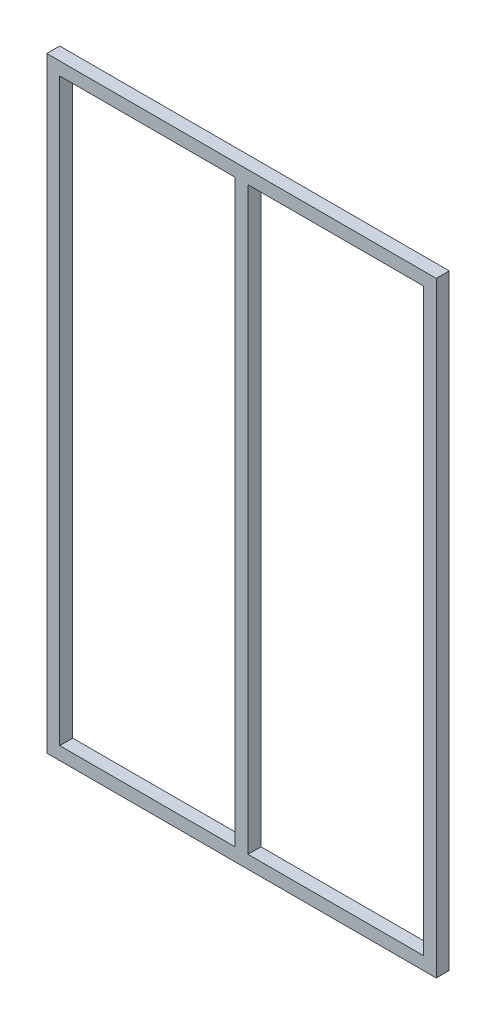
ISO-10303-21;
HEADER;
FILE_DESCRIPTION(('STEP AP214'),'2;1');
FILE_NAME('part.step','',(''),(''),'','','');
FILE_SCHEMA(('AUTOMOTIVE_DESIGN { 1 0 10303 214 1 1 1 1 }'));
ENDSEC;
DATA;
#1=APPLICATION_CONTEXT('core data for automotive mechanical design processes');
#2=APPLICATION_PROTOCOL_DEFINITION('international standard','automotive_design',2000,#1);
#3=PRODUCT_CONTEXT('',#1,'mechanical');
#4=PRODUCT('Part','Part','',(#3));
#5=PRODUCT_RELATED_PRODUCT_CATEGORY('part','',(#4));
#6=PRODUCT_DEFINITION_FORMATION('','',#4);
#7=PRODUCT_DEFINITION_CONTEXT('part definition',#1,'design');
#8=PRODUCT_DEFINITION('design','',#6,#7);
#9=PRODUCT_DEFINITION_SHAPE('','',#8);
#10=(LENGTH_UNIT() NAMED_UNIT(*) SI_UNIT(.MILLI.,.METRE.));
#11=(NAMED_UNIT(*) PLANE_ANGLE_UNIT() SI_UNIT($,.RADIAN.));
#12=(NAMED_UNIT(*) SI_UNIT($,.STERADIAN.) SOLID_ANGLE_UNIT());
#13=UNCERTAINTY_MEASURE_WITH_UNIT(LENGTH_MEASURE(1.E-05),#10,'distance_accuracy_value','');
#14=(GEOMETRIC_REPRESENTATION_CONTEXT(3) GLOBAL_UNCERTAINTY_ASSIGNED_CONTEXT((#13)) GLOBAL_UNIT_ASSIGNED_CONTEXT((#10,
#11,#12)) REPRESENTATION_CONTEXT('',''));
#15=CARTESIAN_POINT('',(0.,0.,0.));
#16=DIRECTION('',(0.,0.,1.));
#17=DIRECTION('',(1.,0.,0.));
#18=AXIS2_PLACEMENT_3D('',#15,#16,#17);
#19=CARTESIAN_POINT('',(285.75,-444.5,-19.05));
#20=DIRECTION('',(1.,0.,0.));
#21=DIRECTION('',(0.,0.,-1.));
#22=AXIS2_PLACEMENT_3D('',#19,#20,#21);
#23=PLANE('',#22);
#24=DIRECTION('',(0.,1.,0.));
#25=VECTOR('',#24,1.);
#26=CARTESIAN_POINT('',(285.75,-444.5,0.));
#27=LINE('',#26,#25);
#28=CARTESIAN_POINT('',(285.75,-444.5,0.));
#29=VERTEX_POINT('',#28);
#30=CARTESIAN_POINT('',(285.75,444.5,0.));
#31=VERTEX_POINT('',#30);
#32=EDGE_CURVE('E159',#29,#31,#27,.T.);
#33=ORIENTED_EDGE('',*,*,#32,.F.);
#34=DIRECTION('',(0.,0.,1.));
#35=VECTOR('',#34,1.);
#36=CARTESIAN_POINT('',(285.75,-444.5,-19.05));
#37=LINE('',#36,#35);
#38=CARTESIAN_POINT('',(285.75,-444.5,-19.05));
#39=VERTEX_POINT('',#38);
#40=EDGE_CURVE('E11',#39,#29,#37,.T.);
#41=ORIENTED_EDGE('',*,*,#40,.F.);
#42=DIRECTION('',(0.,1.,0.));
#43=VECTOR('',#42,1.);
#44=CARTESIAN_POINT('',(285.75,-444.5,-19.05));
#45=LINE('',#44,#43);
#46=CARTESIAN_POINT('',(285.75,444.5,-19.05));
#47=VERTEX_POINT('',#46);
#48=EDGE_CURVE('E192',#39,#47,#45,.T.);
#49=ORIENTED_EDGE('',*,*,#48,.T.);
#50=DIRECTION('',(0.,0.,1.));
#51=VECTOR('',#50,1.);
#52=CARTESIAN_POINT('',(285.75,444.5,-19.05));
#53=LINE('',#52,#51);
#54=EDGE_CURVE('E35',#47,#31,#53,.T.);
#55=ORIENTED_EDGE('',*,*,#54,.T.);
#56=EDGE_LOOP('',(#33,#41,#49,#55));
#57=FACE_BOUND('',#56,.T.);
#58=ADVANCED_FACE('F32',(#57),#23,.T.);
#59=CARTESIAN_POINT('',(-285.75,-444.5,-19.05));
#60=DIRECTION('',(0.,-1.,0.));
#61=DIRECTION('',(0.,0.,-1.));
#62=AXIS2_PLACEMENT_3D('',#59,#60,#61);
#63=PLANE('',#62);
#64=DIRECTION('',(1.,0.,0.));
#65=VECTOR('',#64,1.);
#66=CARTESIAN_POINT('',(-285.75,-444.5,0.));
#67=LINE('',#66,#65);
#68=CARTESIAN_POINT('',(-285.75,-444.5,0.));
#69=VERTEX_POINT('',#68);
#70=EDGE_CURVE('E196',#69,#29,#67,.T.);
#71=ORIENTED_EDGE('',*,*,#70,.F.);
#72=DIRECTION('',(0.,0.,1.));
#73=VECTOR('',#72,1.);
#74=CARTESIAN_POINT('',(-285.75,-444.5,-19.05));
#75=LINE('',#74,#73);
#76=CARTESIAN_POINT('',(-285.75,-444.5,-19.05));
#77=VERTEX_POINT('',#76);
#78=EDGE_CURVE('E40',#77,#69,#75,.T.);
#79=ORIENTED_EDGE('',*,*,#78,.F.);
#80=DIRECTION('',(1.,0.,0.));
#81=VECTOR('',#80,1.);
#82=CARTESIAN_POINT('',(-285.75,-444.5,-19.05));
#83=LINE('',#82,#81);
#84=EDGE_CURVE('E202',#77,#39,#83,.T.);
#85=ORIENTED_EDGE('',*,*,#84,.T.);
#86=ORIENTED_EDGE('',*,*,#40,.T.);
#87=EDGE_LOOP('',(#71,#79,#85,#86));
#88=FACE_BOUND('',#87,.T.);
#89=ADVANCED_FACE('F228',(#88),#63,.T.);
#90=CARTESIAN_POINT('',(-285.75,-444.5,-19.05));
#91=DIRECTION('',(-1.,0.,0.));
#92=DIRECTION('',(0.,0.,1.));
#93=AXIS2_PLACEMENT_3D('',#90,#91,#92);
#94=PLANE('',#93);
#95=DIRECTION('',(0.,-1.,0.));
#96=VECTOR('',#95,1.);
#97=CARTESIAN_POINT('',(-285.75,-444.5,0.));
#98=LINE('',#97,#96);
#99=CARTESIAN_POINT('',(-285.75,444.5,0.));
#100=VERTEX_POINT('',#99);
#101=EDGE_CURVE('E210',#100,#69,#98,.T.);
#102=ORIENTED_EDGE('',*,*,#101,.F.);
#103=DIRECTION('',(0.,0.,1.));
#104=VECTOR('',#103,1.);
#105=CARTESIAN_POINT('',(-285.75,444.5,-19.05));
#106=LINE('',#105,#104);
#107=CARTESIAN_POINT('',(-285.75,444.5,-19.05));
#108=VERTEX_POINT('',#107);
#109=EDGE_CURVE('E215',#108,#100,#106,.T.);
#110=ORIENTED_EDGE('',*,*,#109,.F.);
#111=DIRECTION('',(0.,-1.,0.));
#112=VECTOR('',#111,1.);
#113=CARTESIAN_POINT('',(-285.75,-444.5,-19.05));
#114=LINE('',#113,#112);
#115=EDGE_CURVE('E199',#108,#77,#114,.T.);
#116=ORIENTED_EDGE('',*,*,#115,.T.);
#117=ORIENTED_EDGE('',*,*,#78,.T.);
#118=EDGE_LOOP('',(#102,#110,#116,#117));
#119=FACE_BOUND('',#118,.T.);
#120=ADVANCED_FACE('F233',(#119),#94,.T.);
#121=CARTESIAN_POINT('',(-285.75,444.5,-19.05));
#122=DIRECTION('',(0.,1.,0.));
#123=DIRECTION('',(0.,0.,1.));
#124=AXIS2_PLACEMENT_3D('',#121,#122,#123);
#125=PLANE('',#124);
#126=DIRECTION('',(-1.,0.,0.));
#127=VECTOR('',#126,1.);
#128=CARTESIAN_POINT('',(-285.75,444.5,0.));
#129=LINE('',#128,#127);
#130=EDGE_CURVE('E207',#31,#100,#129,.T.);
#131=ORIENTED_EDGE('',*,*,#130,.F.);
#132=ORIENTED_EDGE('',*,*,#54,.F.);
#133=DIRECTION('',(-1.,0.,0.));
#134=VECTOR('',#133,1.);
#135=CARTESIAN_POINT('',(-285.75,444.5,-19.05));
#136=LINE('',#135,#134);
#137=EDGE_CURVE('E195',#47,#108,#136,.T.);
#138=ORIENTED_EDGE('',*,*,#137,.T.);
#139=ORIENTED_EDGE('',*,*,#109,.T.);
#140=EDGE_LOOP('',(#131,#132,#138,#139));
#141=FACE_BOUND('',#140,.T.);
#142=ADVANCED_FACE('F223',(#141),#125,.T.);
#143=CARTESIAN_POINT('',(0.,0.,-19.05));
#144=DIRECTION('',(0.,0.,-1.));
#145=DIRECTION('',(-1.,0.,0.));
#146=AXIS2_PLACEMENT_3D('',#143,#144,#145);
#147=PLANE('',#146);
#148=DIRECTION('',(0.,-1.,0.));
#149=VECTOR('',#148,1.);
#150=CARTESIAN_POINT('',(-266.7,425.45,-19.05));
#151=LINE('',#150,#149);
#152=CARTESIAN_POINT('',(-266.7,425.45,-19.05));
#153=VERTEX_POINT('',#152);
#154=CARTESIAN_POINT('',(-266.7,-425.45,-19.05));
#155=VERTEX_POINT('',#154);
#156=EDGE_CURVE('E125',#153,#155,#151,.T.);
#157=ORIENTED_EDGE('',*,*,#156,.T.);
#158=DIRECTION('',(1.,0.,0.));
#159=VECTOR('',#158,1.);
#160=CARTESIAN_POINT('',(-266.7,-425.45,-19.05));
#161=LINE('',#160,#159);
#162=CARTESIAN_POINT('',(-9.5249999999999,-425.45,-19.05));
#163=VERTEX_POINT('',#162);
#164=EDGE_CURVE('E136',#155,#163,#161,.T.);
#165=ORIENTED_EDGE('',*,*,#164,.T.);
#166=DIRECTION('',(0.,1.,0.));
#167=VECTOR('',#166,1.);
#168=CARTESIAN_POINT('',(-9.52500000000001,425.45,-19.05));
#169=LINE('',#168,#167);
#170=CARTESIAN_POINT('',(-9.52500000000001,425.45,-19.05));
#171=VERTEX_POINT('',#170);
#172=EDGE_CURVE('E48',#163,#171,#169,.T.);
#173=ORIENTED_EDGE('',*,*,#172,.T.);
#174=DIRECTION('',(-1.,0.,0.));
#175=VECTOR('',#174,1.);
#176=CARTESIAN_POINT('',(-266.7,425.45,-19.05));
#177=LINE('',#176,#175);
#178=EDGE_CURVE('E133',#171,#153,#177,.T.);
#179=ORIENTED_EDGE('',*,*,#178,.T.);
#180=EDGE_LOOP('',(#157,#165,#173,#179));
#181=FACE_BOUND('',#180,.T.);
#182=DIRECTION('',(-1.,0.,0.));
#183=VECTOR('',#182,1.);
#184=CARTESIAN_POINT('',(266.7,425.45,-19.05));
#185=LINE('',#184,#183);
#186=CARTESIAN_POINT('',(266.7,425.45,-19.05));
#187=VERTEX_POINT('',#186);
#188=CARTESIAN_POINT('',(9.52500000000001,425.45,-19.05));
#189=VERTEX_POINT('',#188);
#190=EDGE_CURVE('E163',#187,#189,#185,.T.);
#191=ORIENTED_EDGE('',*,*,#190,.T.);
#192=DIRECTION('',(0.,-1.,0.));
#193=VECTOR('',#192,1.);
#194=CARTESIAN_POINT('',(9.52500000000001,425.45,-19.05));
#195=LINE('',#194,#193);
#196=CARTESIAN_POINT('',(9.5249999999999,-425.45,-19.05));
#197=VERTEX_POINT('',#196);
#198=EDGE_CURVE('E166',#189,#197,#195,.T.);
#199=ORIENTED_EDGE('',*,*,#198,.T.);
#200=DIRECTION('',(1.,0.,0.));
#201=VECTOR('',#200,1.);
#202=CARTESIAN_POINT('',(266.7,-425.45,-19.05));
#203=LINE('',#202,#201);
#204=CARTESIAN_POINT('',(266.7,-425.45,-19.05));
#205=VERTEX_POINT('',#204);
#206=EDGE_CURVE('E56',#197,#205,#203,.T.);
#207=ORIENTED_EDGE('',*,*,#206,.T.);
#208=DIRECTION('',(0.,1.,0.));
#209=VECTOR('',#208,1.);
#210=CARTESIAN_POINT('',(266.7,425.45,-19.05));
#211=LINE('',#210,#209);
#212=EDGE_CURVE('E171',#205,#187,#211,.T.);
#213=ORIENTED_EDGE('',*,*,#212,.T.);
#214=EDGE_LOOP('',(#191,#199,#207,#213));
#215=FACE_BOUND('',#214,.T.);
#216=ORIENTED_EDGE('',*,*,#48,.F.);
#217=ORIENTED_EDGE('',*,*,#84,.F.);
#218=ORIENTED_EDGE('',*,*,#115,.F.);
#219=ORIENTED_EDGE('',*,*,#137,.F.);
#220=EDGE_LOOP('',(#216,#217,#218,#219));
#221=FACE_BOUND('',#220,.T.);
#222=ADVANCED_FACE('F140',(#181,#215,#221),#147,.T.);
#223=CARTESIAN_POINT('',(0.,0.,0.));
#224=DIRECTION('',(0.,0.,-1.));
#225=DIRECTION('',(-1.,0.,0.));
#226=AXIS2_PLACEMENT_3D('',#223,#224,#225);
#227=PLANE('',#226);
#228=DIRECTION('',(1.,0.,0.));
#229=VECTOR('',#228,1.);
#230=CARTESIAN_POINT('',(-266.7,-425.45,0.));
#231=LINE('',#230,#229);
#232=CARTESIAN_POINT('',(-266.7,-425.45,0.));
#233=VERTEX_POINT('',#232);
#234=CARTESIAN_POINT('',(-9.5249999999999,-425.45,0.));
#235=VERTEX_POINT('',#234);
#236=EDGE_CURVE('E152',#233,#235,#231,.T.);
#237=ORIENTED_EDGE('',*,*,#236,.F.);
#238=DIRECTION('',(0.,-1.,0.));
#239=VECTOR('',#238,1.);
#240=CARTESIAN_POINT('',(-266.7,425.45,0.));
#241=LINE('',#240,#239);
#242=CARTESIAN_POINT('',(-266.7,425.45,0.));
#243=VERTEX_POINT('',#242);
#244=EDGE_CURVE('E128',#243,#233,#241,.T.);
#245=ORIENTED_EDGE('',*,*,#244,.F.);
#246=DIRECTION('',(-1.,0.,0.));
#247=VECTOR('',#246,1.);
#248=CARTESIAN_POINT('',(-266.7,425.45,0.));
#249=LINE('',#248,#247);
#250=CARTESIAN_POINT('',(-9.52500000000001,425.45,0.));
#251=VERTEX_POINT('',#250);
#252=EDGE_CURVE('E143',#251,#243,#249,.T.);
#253=ORIENTED_EDGE('',*,*,#252,.F.);
#254=DIRECTION('',(0.,1.,0.));
#255=VECTOR('',#254,1.);
#256=CARTESIAN_POINT('',(-9.52500000000001,425.45,0.));
#257=LINE('',#256,#255);
#258=EDGE_CURVE('E146',#235,#251,#257,.T.);
#259=ORIENTED_EDGE('',*,*,#258,.F.);
#260=EDGE_LOOP('',(#237,#245,#253,#259));
#261=FACE_BOUND('',#260,.T.);
#262=DIRECTION('',(0.,-1.,0.));
#263=VECTOR('',#262,1.);
#264=CARTESIAN_POINT('',(9.52500000000001,425.45,0.));
#265=LINE('',#264,#263);
#266=CARTESIAN_POINT('',(9.52500000000001,425.45,0.));
#267=VERTEX_POINT('',#266);
#268=CARTESIAN_POINT('',(9.5249999999999,-425.45,0.));
#269=VERTEX_POINT('',#268);
#270=EDGE_CURVE('E177',#267,#269,#265,.T.);
#271=ORIENTED_EDGE('',*,*,#270,.F.);
#272=DIRECTION('',(-1.,0.,0.));
#273=VECTOR('',#272,1.);
#274=CARTESIAN_POINT('',(266.7,425.45,0.));
#275=LINE('',#274,#273);
#276=CARTESIAN_POINT('',(266.7,425.45,0.));
#277=VERTEX_POINT('',#276);
#278=EDGE_CURVE('E175',#277,#267,#275,.T.);
#279=ORIENTED_EDGE('',*,*,#278,.F.);
#280=DIRECTION('',(0.,1.,0.));
#281=VECTOR('',#280,1.);
#282=CARTESIAN_POINT('',(266.7,425.45,0.));
#283=LINE('',#282,#281);
#284=CARTESIAN_POINT('',(266.7,-425.45,0.));
#285=VERTEX_POINT('',#284);
#286=EDGE_CURVE('E167',#285,#277,#283,.T.);
#287=ORIENTED_EDGE('',*,*,#286,.F.);
#288=DIRECTION('',(1.,0.,0.));
#289=VECTOR('',#288,1.);
#290=CARTESIAN_POINT('',(266.7,-425.45,0.));
#291=LINE('',#290,#289);
#292=EDGE_CURVE('E180',#269,#285,#291,.T.);
#293=ORIENTED_EDGE('',*,*,#292,.F.);
#294=EDGE_LOOP('',(#271,#279,#287,#293));
#295=FACE_BOUND('',#294,.T.);
#296=ORIENTED_EDGE('',*,*,#32,.T.);
#297=ORIENTED_EDGE('',*,*,#130,.T.);
#298=ORIENTED_EDGE('',*,*,#101,.T.);
#299=ORIENTED_EDGE('',*,*,#70,.T.);
#300=EDGE_LOOP('',(#296,#297,#298,#299));
#301=FACE_BOUND('',#300,.T.);
#302=ADVANCED_FACE('F225',(#261,#295,#301),#227,.F.);
#303=CARTESIAN_POINT('',(266.7,425.45,-19.05));
#304=DIRECTION('',(0.,1.,0.));
#305=DIRECTION('',(-1.,0.,0.));
#306=AXIS2_PLACEMENT_3D('',#303,#304,#305);
#307=PLANE('',#306);
#308=ORIENTED_EDGE('',*,*,#278,.T.);
#309=DIRECTION('',(0.,0.,1.));
#310=VECTOR('',#309,1.);
#311=CARTESIAN_POINT('',(9.52500000000001,425.45,-19.05));
#312=LINE('',#311,#310);
#313=EDGE_CURVE('E174',#189,#267,#312,.T.);
#314=ORIENTED_EDGE('',*,*,#313,.F.);
#315=ORIENTED_EDGE('',*,*,#190,.F.);
#316=DIRECTION('',(0.,0.,1.));
#317=VECTOR('',#316,1.);
#318=CARTESIAN_POINT('',(266.7,425.45,-19.05));
#319=LINE('',#318,#317);
#320=EDGE_CURVE('E153',#187,#277,#319,.T.);
#321=ORIENTED_EDGE('',*,*,#320,.T.);
#322=EDGE_LOOP('',(#308,#314,#315,#321));
#323=FACE_BOUND('',#322,.T.);
#324=ADVANCED_FACE('F275',(#323),#307,.F.);
#325=CARTESIAN_POINT('',(266.7,425.45,-19.05));
#326=DIRECTION('',(1.,0.,0.));
#327=DIRECTION('',(0.,1.,0.));
#328=AXIS2_PLACEMENT_3D('',#325,#326,#327);
#329=PLANE('',#328);
#330=ORIENTED_EDGE('',*,*,#286,.T.);
#331=ORIENTED_EDGE('',*,*,#320,.F.);
#332=ORIENTED_EDGE('',*,*,#212,.F.);
#333=DIRECTION('',(0.,0.,1.));
#334=VECTOR('',#333,1.);
#335=CARTESIAN_POINT('',(266.7,-425.45,-19.05));
#336=LINE('',#335,#334);
#337=EDGE_CURVE('E186',#205,#285,#336,.T.);
#338=ORIENTED_EDGE('',*,*,#337,.T.);
#339=EDGE_LOOP('',(#330,#331,#332,#338));
#340=FACE_BOUND('',#339,.T.);
#341=ADVANCED_FACE('F285',(#340),#329,.F.);
#342=CARTESIAN_POINT('',(266.7,-425.45,-19.05));
#343=DIRECTION('',(0.,-1.,0.));
#344=DIRECTION('',(1.,0.,0.));
#345=AXIS2_PLACEMENT_3D('',#342,#343,#344);
#346=PLANE('',#345);
#347=ORIENTED_EDGE('',*,*,#292,.T.);
#348=ORIENTED_EDGE('',*,*,#337,.F.);
#349=ORIENTED_EDGE('',*,*,#206,.F.);
#350=DIRECTION('',(0.,0.,1.));
#351=VECTOR('',#350,1.);
#352=CARTESIAN_POINT('',(9.5249999999999,-425.45,-19.05));
#353=LINE('',#352,#351);
#354=EDGE_CURVE('E188',#197,#269,#353,.T.);
#355=ORIENTED_EDGE('',*,*,#354,.T.);
#356=EDGE_LOOP('',(#347,#348,#349,#355));
#357=FACE_BOUND('',#356,.T.);
#358=ADVANCED_FACE('F295',(#357),#346,.F.);
#359=CARTESIAN_POINT('',(9.52500000000001,425.45,-19.05));
#360=DIRECTION('',(-1.,0.,0.));
#361=DIRECTION('',(0.,-1.,0.));
#362=AXIS2_PLACEMENT_3D('',#359,#360,#361);
#363=PLANE('',#362);
#364=ORIENTED_EDGE('',*,*,#270,.T.);
#365=ORIENTED_EDGE('',*,*,#354,.F.);
#366=ORIENTED_EDGE('',*,*,#198,.F.);
#367=ORIENTED_EDGE('',*,*,#313,.T.);
#368=EDGE_LOOP('',(#364,#365,#366,#367));
#369=FACE_BOUND('',#368,.T.);
#370=ADVANCED_FACE('F305',(#369),#363,.F.);
#371=CARTESIAN_POINT('',(-266.7,425.45,-19.05));
#372=DIRECTION('',(-1.,0.,0.));
#373=DIRECTION('',(0.,-1.,0.));
#374=AXIS2_PLACEMENT_3D('',#371,#372,#373);
#375=PLANE('',#374);
#376=ORIENTED_EDGE('',*,*,#244,.T.);
#377=DIRECTION('',(0.,0.,1.));
#378=VECTOR('',#377,1.);
#379=CARTESIAN_POINT('',(-266.7,-425.45,-19.05));
#380=LINE('',#379,#378);
#381=EDGE_CURVE('E121',#155,#233,#380,.T.);
#382=ORIENTED_EDGE('',*,*,#381,.F.);
#383=ORIENTED_EDGE('',*,*,#156,.F.);
#384=DIRECTION('',(0.,0.,1.));
#385=VECTOR('',#384,1.);
#386=CARTESIAN_POINT('',(-266.7,425.45,-19.05));
#387=LINE('',#386,#385);
#388=EDGE_CURVE('E157',#153,#243,#387,.T.);
#389=ORIENTED_EDGE('',*,*,#388,.T.);
#390=EDGE_LOOP('',(#376,#382,#383,#389));
#391=FACE_BOUND('',#390,.T.);
#392=ADVANCED_FACE('F123',(#391),#375,.F.);
#393=CARTESIAN_POINT('',(-266.7,425.45,-19.05));
#394=DIRECTION('',(0.,1.,0.));
#395=DIRECTION('',(-1.,0.,0.));
#396=AXIS2_PLACEMENT_3D('',#393,#394,#395);
#397=PLANE('',#396);
#398=ORIENTED_EDGE('',*,*,#252,.T.);
#399=ORIENTED_EDGE('',*,*,#388,.F.);
#400=ORIENTED_EDGE('',*,*,#178,.F.);
#401=DIRECTION('',(0.,0.,1.));
#402=VECTOR('',#401,1.);
#403=CARTESIAN_POINT('',(-9.52500000000001,425.45,-19.05));
#404=LINE('',#403,#402);
#405=EDGE_CURVE('E160',#171,#251,#404,.T.);
#406=ORIENTED_EDGE('',*,*,#405,.T.);
#407=EDGE_LOOP('',(#398,#399,#400,#406));
#408=FACE_BOUND('',#407,.T.);
#409=ADVANCED_FACE('F323',(#408),#397,.F.);
#410=CARTESIAN_POINT('',(-9.52500000000001,425.45,-19.05));
#411=DIRECTION('',(1.,0.,0.));
#412=DIRECTION('',(0.,1.,0.));
#413=AXIS2_PLACEMENT_3D('',#410,#411,#412);
#414=PLANE('',#413);
#415=ORIENTED_EDGE('',*,*,#258,.T.);
#416=ORIENTED_EDGE('',*,*,#405,.F.);
#417=ORIENTED_EDGE('',*,*,#172,.F.);
#418=DIRECTION('',(0.,0.,1.));
#419=VECTOR('',#418,1.);
#420=CARTESIAN_POINT('',(-9.5249999999999,-425.45,-19.05));
#421=LINE('',#420,#419);
#422=EDGE_CURVE('E132',#163,#235,#421,.T.);
#423=ORIENTED_EDGE('',*,*,#422,.T.);
#424=EDGE_LOOP('',(#415,#416,#417,#423));
#425=FACE_BOUND('',#424,.T.);
#426=ADVANCED_FACE('F332',(#425),#414,.F.);
#427=CARTESIAN_POINT('',(-266.7,-425.45,-19.05));
#428=DIRECTION('',(0.,-1.,0.));
#429=DIRECTION('',(1.,0.,0.));
#430=AXIS2_PLACEMENT_3D('',#427,#428,#429);
#431=PLANE('',#430);
#432=ORIENTED_EDGE('',*,*,#236,.T.);
#433=ORIENTED_EDGE('',*,*,#422,.F.);
#434=ORIENTED_EDGE('',*,*,#164,.F.);
#435=ORIENTED_EDGE('',*,*,#381,.T.);
#436=EDGE_LOOP('',(#432,#433,#434,#435));
#437=FACE_BOUND('',#436,.T.);
#438=ADVANCED_FACE('F137',(#437),#431,.F.);
#439=CLOSED_SHELL('',(#58,#89,#120,#142,#222,#302,#324,#341,#358,#370,#392,#409,#426,#438));
#440=MANIFOLD_SOLID_BREP('B2',#439);
#441=ADVANCED_BREP_SHAPE_REPRESENTATION('',(#18,#440),#14);
#442=SHAPE_DEFINITION_REPRESENTATION(#9,#441);
ENDSEC;
END-ISO-10303-21;
